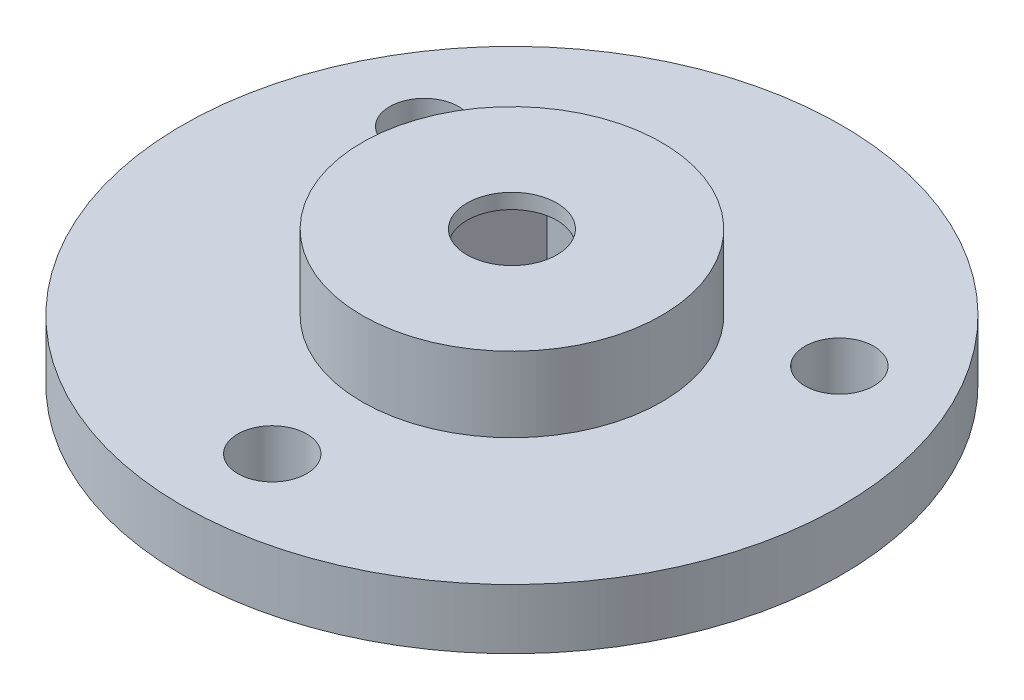
ISO-10303-21;
HEADER;
FILE_DESCRIPTION(('STEP AP214'),'2;1');
FILE_NAME('part.step','',(''),(''),'','','');
FILE_SCHEMA(('AUTOMOTIVE_DESIGN { 1 0 10303 214 1 1 1 1 }'));
ENDSEC;
DATA;
#1=APPLICATION_CONTEXT('core data for automotive mechanical design processes');
#2=APPLICATION_PROTOCOL_DEFINITION('international standard','automotive_design',2000,#1);
#3=PRODUCT_CONTEXT('',#1,'mechanical');
#4=PRODUCT('Part','Part','',(#3));
#5=PRODUCT_RELATED_PRODUCT_CATEGORY('part','',(#4));
#6=PRODUCT_DEFINITION_FORMATION('','',#4);
#7=PRODUCT_DEFINITION_CONTEXT('part definition',#1,'design');
#8=PRODUCT_DEFINITION('design','',#6,#7);
#9=PRODUCT_DEFINITION_SHAPE('','',#8);
#10=(LENGTH_UNIT() NAMED_UNIT(*) SI_UNIT(.MILLI.,.METRE.));
#11=(NAMED_UNIT(*) PLANE_ANGLE_UNIT() SI_UNIT($,.RADIAN.));
#12=(NAMED_UNIT(*) SI_UNIT($,.STERADIAN.) SOLID_ANGLE_UNIT());
#13=UNCERTAINTY_MEASURE_WITH_UNIT(LENGTH_MEASURE(1.E-05),#10,'distance_accuracy_value','');
#14=(GEOMETRIC_REPRESENTATION_CONTEXT(3) GLOBAL_UNCERTAINTY_ASSIGNED_CONTEXT((#13)) GLOBAL_UNIT_ASSIGNED_CONTEXT((#10,
#11,#12)) REPRESENTATION_CONTEXT('',''));
#15=CARTESIAN_POINT('',(0.,0.,0.));
#16=DIRECTION('',(0.,0.,1.));
#17=DIRECTION('',(1.,0.,0.));
#18=AXIS2_PLACEMENT_3D('',#15,#16,#17);
#19=CARTESIAN_POINT('',(0.,2.,0.));
#20=DIRECTION('',(0.,1.,0.));
#21=DIRECTION('',(0.,0.,1.));
#22=AXIS2_PLACEMENT_3D('',#19,#20,#21);
#23=PLANE('',#22);
#24=CARTESIAN_POINT('',(6.92820323027551,2.,-4.));
#25=DIRECTION('',(0.,1.,0.));
#26=DIRECTION('',(0.,0.,1.));
#27=AXIS2_PLACEMENT_3D('',#24,#25,#26);
#28=CIRCLE('',#27,1.15);
#29=CARTESIAN_POINT('',(6.92820323027551,2.,-2.85));
#30=VERTEX_POINT('',#29);
#31=EDGE_CURVE('E137',#30,#30,#28,.T.);
#32=ORIENTED_EDGE('',*,*,#31,.F.);
#33=EDGE_LOOP('',(#32));
#34=FACE_BOUND('',#33,.T.);
#35=CARTESIAN_POINT('',(0.,2.,8.));
#36=DIRECTION('',(0.,1.,0.));
#37=DIRECTION('',(0.,0.,1.));
#38=AXIS2_PLACEMENT_3D('',#35,#36,#37);
#39=CIRCLE('',#38,1.15);
#40=CARTESIAN_POINT('',(0.,2.,9.15));
#41=VERTEX_POINT('',#40);
#42=EDGE_CURVE('E169',#41,#41,#39,.T.);
#43=ORIENTED_EDGE('',*,*,#42,.F.);
#44=EDGE_LOOP('',(#43));
#45=FACE_BOUND('',#44,.T.);
#46=CARTESIAN_POINT('',(0.,2.,0.));
#47=DIRECTION('',(0.,1.,0.));
#48=DIRECTION('',(0.,0.,1.));
#49=AXIS2_PLACEMENT_3D('',#46,#47,#48);
#50=CIRCLE('',#49,11.);
#51=CARTESIAN_POINT('',(0.,2.,11.));
#52=VERTEX_POINT('',#51);
#53=EDGE_CURVE('E11',#52,#52,#50,.T.);
#54=ORIENTED_EDGE('',*,*,#53,.T.);
#55=EDGE_LOOP('',(#54));
#56=FACE_BOUND('',#55,.T.);
#57=CARTESIAN_POINT('',(-6.92820323027551,2.,-4.));
#58=DIRECTION('',(0.,1.,0.));
#59=DIRECTION('',(0.,0.,1.));
#60=AXIS2_PLACEMENT_3D('',#57,#58,#59);
#61=CIRCLE('',#60,1.15);
#62=CARTESIAN_POINT('',(-6.92820323027551,2.,-2.85));
#63=VERTEX_POINT('',#62);
#64=EDGE_CURVE('E143',#63,#63,#61,.T.);
#65=ORIENTED_EDGE('',*,*,#64,.F.);
#66=EDGE_LOOP('',(#65));
#67=FACE_BOUND('',#66,.T.);
#68=CARTESIAN_POINT('',(0.,2.,0.));
#69=DIRECTION('',(0.,1.,0.));
#70=DIRECTION('',(0.,0.,1.));
#71=AXIS2_PLACEMENT_3D('',#68,#69,#70);
#72=CIRCLE('',#71,5.);
#73=CARTESIAN_POINT('',(0.,2.,5.));
#74=VERTEX_POINT('',#73);
#75=EDGE_CURVE('E133',#74,#74,#72,.F.);
#76=ORIENTED_EDGE('',*,*,#75,.T.);
#77=EDGE_LOOP('',(#76));
#78=FACE_BOUND('',#77,.T.);
#79=ADVANCED_FACE('F41',(#34,#45,#56,#67,#78),#23,.T.);
#80=CARTESIAN_POINT('',(0.,0.,0.));
#81=DIRECTION('',(0.,1.,0.));
#82=DIRECTION('',(0.,0.,1.));
#83=AXIS2_PLACEMENT_3D('',#80,#81,#82);
#84=PLANE('',#83);
#85=DIRECTION('',(0.5,0.,-0.866025403784439));
#86=VECTOR('',#85,1.);
#87=CARTESIAN_POINT('',(1.58771324027147,0.,2.75));
#88=LINE('',#87,#86);
#89=CARTESIAN_POINT('',(1.58771324027147,0.,2.75));
#90=VERTEX_POINT('',#89);
#91=CARTESIAN_POINT('',(3.17542648054294,0.,0.));
#92=VERTEX_POINT('',#91);
#93=EDGE_CURVE('E56',#90,#92,#88,.T.);
#94=ORIENTED_EDGE('',*,*,#93,.T.);
#95=DIRECTION('',(-0.5,0.,-0.866025403784438));
#96=VECTOR('',#95,1.);
#97=CARTESIAN_POINT('',(3.17542648054294,0.,0.));
#98=LINE('',#97,#96);
#99=CARTESIAN_POINT('',(1.58771324027147,0.,-2.75));
#100=VERTEX_POINT('',#99);
#101=EDGE_CURVE('E149',#92,#100,#98,.T.);
#102=ORIENTED_EDGE('',*,*,#101,.T.);
#103=DIRECTION('',(-1.,0.,0.));
#104=VECTOR('',#103,1.);
#105=CARTESIAN_POINT('',(1.58771324027147,0.,-2.75));
#106=LINE('',#105,#104);
#107=CARTESIAN_POINT('',(-1.58771324027147,0.,-2.75));
#108=VERTEX_POINT('',#107);
#109=EDGE_CURVE('E113',#100,#108,#106,.T.);
#110=ORIENTED_EDGE('',*,*,#109,.T.);
#111=DIRECTION('',(-0.5,0.,0.866025403784439));
#112=VECTOR('',#111,1.);
#113=CARTESIAN_POINT('',(-1.58771324027147,0.,-2.75));
#114=LINE('',#113,#112);
#115=CARTESIAN_POINT('',(-3.17542648054294,0.,0.));
#116=VERTEX_POINT('',#115);
#117=EDGE_CURVE('E152',#108,#116,#114,.T.);
#118=ORIENTED_EDGE('',*,*,#117,.T.);
#119=DIRECTION('',(0.5,0.,0.866025403784439));
#120=VECTOR('',#119,1.);
#121=CARTESIAN_POINT('',(-3.17542648054294,0.,0.));
#122=LINE('',#121,#120);
#123=CARTESIAN_POINT('',(-1.58771324027147,0.,2.75));
#124=VERTEX_POINT('',#123);
#125=EDGE_CURVE('E155',#116,#124,#122,.T.);
#126=ORIENTED_EDGE('',*,*,#125,.T.);
#127=DIRECTION('',(1.,0.,0.));
#128=VECTOR('',#127,1.);
#129=CARTESIAN_POINT('',(-1.58771324027147,0.,2.75));
#130=LINE('',#129,#128);
#131=EDGE_CURVE('E158',#124,#90,#130,.T.);
#132=ORIENTED_EDGE('',*,*,#131,.T.);
#133=EDGE_LOOP('',(#94,#102,#110,#118,#126,#132));
#134=FACE_BOUND('',#133,.T.);
#135=CARTESIAN_POINT('',(6.92820323027551,0.,-4.));
#136=DIRECTION('',(0.,1.,0.));
#137=DIRECTION('',(0.,0.,1.));
#138=AXIS2_PLACEMENT_3D('',#135,#136,#137);
#139=CIRCLE('',#138,1.15);
#140=CARTESIAN_POINT('',(6.92820323027551,0.,-2.85));
#141=VERTEX_POINT('',#140);
#142=EDGE_CURVE('E136',#141,#141,#139,.T.);
#143=ORIENTED_EDGE('',*,*,#142,.T.);
#144=EDGE_LOOP('',(#143));
#145=FACE_BOUND('',#144,.T.);
#146=CARTESIAN_POINT('',(-6.92820323027551,0.,-4.));
#147=DIRECTION('',(0.,1.,0.));
#148=DIRECTION('',(0.,0.,1.));
#149=AXIS2_PLACEMENT_3D('',#146,#147,#148);
#150=CIRCLE('',#149,1.15);
#151=CARTESIAN_POINT('',(-6.92820323027551,0.,-2.85));
#152=VERTEX_POINT('',#151);
#153=EDGE_CURVE('E140',#152,#152,#150,.T.);
#154=ORIENTED_EDGE('',*,*,#153,.T.);
#155=EDGE_LOOP('',(#154));
#156=FACE_BOUND('',#155,.T.);
#157=CARTESIAN_POINT('',(0.,0.,0.));
#158=DIRECTION('',(0.,1.,0.));
#159=DIRECTION('',(0.,0.,1.));
#160=AXIS2_PLACEMENT_3D('',#157,#158,#159);
#161=CIRCLE('',#160,11.);
#162=CARTESIAN_POINT('',(0.,0.,11.));
#163=VERTEX_POINT('',#162);
#164=EDGE_CURVE('E45',#163,#163,#161,.T.);
#165=ORIENTED_EDGE('',*,*,#164,.F.);
#166=EDGE_LOOP('',(#165));
#167=FACE_BOUND('',#166,.T.);
#168=CARTESIAN_POINT('',(0.,0.,8.));
#169=DIRECTION('',(0.,1.,0.));
#170=DIRECTION('',(0.,0.,1.));
#171=AXIS2_PLACEMENT_3D('',#168,#169,#170);
#172=CIRCLE('',#171,1.15);
#173=CARTESIAN_POINT('',(0.,0.,9.15));
#174=VERTEX_POINT('',#173);
#175=EDGE_CURVE('E168',#174,#174,#172,.T.);
#176=ORIENTED_EDGE('',*,*,#175,.T.);
#177=EDGE_LOOP('',(#176));
#178=FACE_BOUND('',#177,.T.);
#179=ADVANCED_FACE('F175',(#134,#145,#156,#167,#178),#84,.F.);
#180=CARTESIAN_POINT('',(0.,2.,0.));
#181=DIRECTION('',(0.,-1.,0.));
#182=DIRECTION('',(0.,0.,-1.));
#183=AXIS2_PLACEMENT_3D('',#180,#181,#182);
#184=CYLINDRICAL_SURFACE('',#183,11.);
#185=ORIENTED_EDGE('',*,*,#53,.F.);
#186=EDGE_LOOP('',(#185));
#187=FACE_BOUND('',#186,.T.);
#188=ORIENTED_EDGE('',*,*,#164,.T.);
#189=EDGE_LOOP('',(#188));
#190=FACE_BOUND('',#189,.T.);
#191=ADVANCED_FACE('F43',(#187,#190),#184,.T.);
#192=CARTESIAN_POINT('',(0.,2.,8.));
#193=DIRECTION('',(0.,-1.,0.));
#194=DIRECTION('',(0.,0.,-1.));
#195=AXIS2_PLACEMENT_3D('',#192,#193,#194);
#196=CYLINDRICAL_SURFACE('',#195,1.15);
#197=ORIENTED_EDGE('',*,*,#42,.T.);
#198=EDGE_LOOP('',(#197));
#199=FACE_BOUND('',#198,.T.);
#200=ORIENTED_EDGE('',*,*,#175,.F.);
#201=EDGE_LOOP('',(#200));
#202=FACE_BOUND('',#201,.T.);
#203=ADVANCED_FACE('F177',(#199,#202),#196,.F.);
#204=CARTESIAN_POINT('',(1.58771324027147,2.,2.75));
#205=DIRECTION('',(-0.866025403784439,0.,-0.5));
#206=DIRECTION('',(-0.5,0.,0.866025403784439));
#207=AXIS2_PLACEMENT_3D('',#204,#205,#206);
#208=PLANE('',#207);
#209=ORIENTED_EDGE('',*,*,#93,.F.);
#210=DIRECTION('',(0.,-1.,0.));
#211=VECTOR('',#210,1.);
#212=CARTESIAN_POINT('',(1.58771324027147,2.,2.75));
#213=LINE('',#212,#211);
#214=CARTESIAN_POINT('',(1.58771324027147,4.,2.75));
#215=VERTEX_POINT('',#214);
#216=EDGE_CURVE('E161',#215,#90,#213,.T.);
#217=ORIENTED_EDGE('',*,*,#216,.F.);
#218=DIRECTION('',(0.5,0.,-0.866025403784439));
#219=VECTOR('',#218,1.);
#220=CARTESIAN_POINT('',(1.58771324027147,4.,2.75));
#221=LINE('',#220,#219);
#222=CARTESIAN_POINT('',(3.17542648054294,4.,0.));
#223=VERTEX_POINT('',#222);
#224=EDGE_CURVE('E121',#215,#223,#221,.T.);
#225=ORIENTED_EDGE('',*,*,#224,.T.);
#226=DIRECTION('',(0.,-1.,0.));
#227=VECTOR('',#226,1.);
#228=CARTESIAN_POINT('',(3.17542648054294,2.,0.));
#229=LINE('',#228,#227);
#230=EDGE_CURVE('E116',#223,#92,#229,.T.);
#231=ORIENTED_EDGE('',*,*,#230,.T.);
#232=EDGE_LOOP('',(#209,#217,#225,#231));
#233=FACE_BOUND('',#232,.T.);
#234=ADVANCED_FACE('F179',(#233),#208,.T.);
#235=CARTESIAN_POINT('',(3.17542648054294,2.,0.));
#236=DIRECTION('',(-0.866025403784439,0.,0.5));
#237=DIRECTION('',(0.5,0.,0.866025403784438));
#238=AXIS2_PLACEMENT_3D('',#235,#236,#237);
#239=PLANE('',#238);
#240=ORIENTED_EDGE('',*,*,#101,.F.);
#241=ORIENTED_EDGE('',*,*,#230,.F.);
#242=DIRECTION('',(-0.5,0.,-0.866025403784438));
#243=VECTOR('',#242,1.);
#244=CARTESIAN_POINT('',(3.17542648054294,4.,0.));
#245=LINE('',#244,#243);
#246=CARTESIAN_POINT('',(1.58771324027147,4.,-2.75));
#247=VERTEX_POINT('',#246);
#248=EDGE_CURVE('E102',#223,#247,#245,.T.);
#249=ORIENTED_EDGE('',*,*,#248,.T.);
#250=DIRECTION('',(0.,-1.,0.));
#251=VECTOR('',#250,1.);
#252=CARTESIAN_POINT('',(1.58771324027147,2.,-2.75));
#253=LINE('',#252,#251);
#254=EDGE_CURVE('E110',#247,#100,#253,.T.);
#255=ORIENTED_EDGE('',*,*,#254,.T.);
#256=EDGE_LOOP('',(#240,#241,#249,#255));
#257=FACE_BOUND('',#256,.T.);
#258=ADVANCED_FACE('F119',(#257),#239,.T.);
#259=CARTESIAN_POINT('',(1.58771324027147,2.,-2.75));
#260=DIRECTION('',(0.,0.,1.));
#261=DIRECTION('',(1.,0.,0.));
#262=AXIS2_PLACEMENT_3D('',#259,#260,#261);
#263=PLANE('',#262);
#264=ORIENTED_EDGE('',*,*,#109,.F.);
#265=ORIENTED_EDGE('',*,*,#254,.F.);
#266=DIRECTION('',(-1.,0.,0.));
#267=VECTOR('',#266,1.);
#268=CARTESIAN_POINT('',(1.58771324027147,4.,-2.75));
#269=LINE('',#268,#267);
#270=CARTESIAN_POINT('',(-1.58771324027147,4.,-2.75));
#271=VERTEX_POINT('',#270);
#272=EDGE_CURVE('E97',#247,#271,#269,.T.);
#273=ORIENTED_EDGE('',*,*,#272,.T.);
#274=DIRECTION('',(0.,-1.,0.));
#275=VECTOR('',#274,1.);
#276=CARTESIAN_POINT('',(-1.58771324027147,2.,-2.75));
#277=LINE('',#276,#275);
#278=EDGE_CURVE('E117',#271,#108,#277,.T.);
#279=ORIENTED_EDGE('',*,*,#278,.T.);
#280=EDGE_LOOP('',(#264,#265,#273,#279));
#281=FACE_BOUND('',#280,.T.);
#282=ADVANCED_FACE('F111',(#281),#263,.T.);
#283=CARTESIAN_POINT('',(-1.58771324027147,2.,-2.75));
#284=DIRECTION('',(0.866025403784439,0.,0.5));
#285=DIRECTION('',(0.5,0.,-0.866025403784439));
#286=AXIS2_PLACEMENT_3D('',#283,#284,#285);
#287=PLANE('',#286);
#288=ORIENTED_EDGE('',*,*,#117,.F.);
#289=ORIENTED_EDGE('',*,*,#278,.F.);
#290=DIRECTION('',(-0.5,0.,0.866025403784439));
#291=VECTOR('',#290,1.);
#292=CARTESIAN_POINT('',(-1.58771324027147,4.,-2.75));
#293=LINE('',#292,#291);
#294=CARTESIAN_POINT('',(-3.17542648054294,4.,0.));
#295=VERTEX_POINT('',#294);
#296=EDGE_CURVE('E105',#271,#295,#293,.T.);
#297=ORIENTED_EDGE('',*,*,#296,.T.);
#298=DIRECTION('',(0.,-1.,0.));
#299=VECTOR('',#298,1.);
#300=CARTESIAN_POINT('',(-3.17542648054294,2.,0.));
#301=LINE('',#300,#299);
#302=EDGE_CURVE('E164',#295,#116,#301,.T.);
#303=ORIENTED_EDGE('',*,*,#302,.T.);
#304=EDGE_LOOP('',(#288,#289,#297,#303));
#305=FACE_BOUND('',#304,.T.);
#306=ADVANCED_FACE('F247',(#305),#287,.T.);
#307=CARTESIAN_POINT('',(-3.17542648054294,2.,0.));
#308=DIRECTION('',(0.866025403784439,0.,-0.5));
#309=DIRECTION('',(-0.5,0.,-0.866025403784439));
#310=AXIS2_PLACEMENT_3D('',#307,#308,#309);
#311=PLANE('',#310);
#312=ORIENTED_EDGE('',*,*,#125,.F.);
#313=ORIENTED_EDGE('',*,*,#302,.F.);
#314=DIRECTION('',(0.5,0.,0.866025403784439));
#315=VECTOR('',#314,1.);
#316=CARTESIAN_POINT('',(-3.17542648054294,4.,0.));
#317=LINE('',#316,#315);
#318=CARTESIAN_POINT('',(-1.58771324027147,4.,2.75));
#319=VERTEX_POINT('',#318);
#320=EDGE_CURVE('E128',#295,#319,#317,.T.);
#321=ORIENTED_EDGE('',*,*,#320,.T.);
#322=DIRECTION('',(0.,-1.,0.));
#323=VECTOR('',#322,1.);
#324=CARTESIAN_POINT('',(-1.58771324027147,2.,2.75));
#325=LINE('',#324,#323);
#326=EDGE_CURVE('E64',#319,#124,#325,.T.);
#327=ORIENTED_EDGE('',*,*,#326,.T.);
#328=EDGE_LOOP('',(#312,#313,#321,#327));
#329=FACE_BOUND('',#328,.T.);
#330=ADVANCED_FACE('F243',(#329),#311,.T.);
#331=CARTESIAN_POINT('',(-1.58771324027147,2.,2.75));
#332=DIRECTION('',(0.,0.,-1.));
#333=DIRECTION('',(-1.,0.,0.));
#334=AXIS2_PLACEMENT_3D('',#331,#332,#333);
#335=PLANE('',#334);
#336=ORIENTED_EDGE('',*,*,#131,.F.);
#337=ORIENTED_EDGE('',*,*,#326,.F.);
#338=DIRECTION('',(1.,0.,0.));
#339=VECTOR('',#338,1.);
#340=CARTESIAN_POINT('',(-1.58771324027147,4.,2.75));
#341=LINE('',#340,#339);
#342=EDGE_CURVE('E130',#319,#215,#341,.T.);
#343=ORIENTED_EDGE('',*,*,#342,.T.);
#344=ORIENTED_EDGE('',*,*,#216,.T.);
#345=EDGE_LOOP('',(#336,#337,#343,#344));
#346=FACE_BOUND('',#345,.T.);
#347=ADVANCED_FACE('F239',(#346),#335,.T.);
#348=CARTESIAN_POINT('',(-6.92820323027551,2.,-4.));
#349=DIRECTION('',(0.,-1.,0.));
#350=DIRECTION('',(0.,0.,-1.));
#351=AXIS2_PLACEMENT_3D('',#348,#349,#350);
#352=CYLINDRICAL_SURFACE('',#351,1.15);
#353=ORIENTED_EDGE('',*,*,#64,.T.);
#354=EDGE_LOOP('',(#353));
#355=FACE_BOUND('',#354,.T.);
#356=ORIENTED_EDGE('',*,*,#153,.F.);
#357=EDGE_LOOP('',(#356));
#358=FACE_BOUND('',#357,.T.);
#359=ADVANCED_FACE('F236',(#355,#358),#352,.F.);
#360=CARTESIAN_POINT('',(6.92820323027551,2.,-4.));
#361=DIRECTION('',(0.,-1.,0.));
#362=DIRECTION('',(0.,0.,-1.));
#363=AXIS2_PLACEMENT_3D('',#360,#361,#362);
#364=CYLINDRICAL_SURFACE('',#363,1.15);
#365=ORIENTED_EDGE('',*,*,#31,.T.);
#366=EDGE_LOOP('',(#365));
#367=FACE_BOUND('',#366,.T.);
#368=ORIENTED_EDGE('',*,*,#142,.F.);
#369=EDGE_LOOP('',(#368));
#370=FACE_BOUND('',#369,.T.);
#371=ADVANCED_FACE('F211',(#367,#370),#364,.F.);
#372=CARTESIAN_POINT('',(0.,4.,0.));
#373=DIRECTION('',(0.,-1.,0.));
#374=DIRECTION('',(0.,0.,-1.));
#375=AXIS2_PLACEMENT_3D('',#372,#373,#374);
#376=CYLINDRICAL_SURFACE('',#375,5.);
#377=ORIENTED_EDGE('',*,*,#75,.F.);
#378=EDGE_LOOP('',(#377));
#379=FACE_BOUND('',#378,.T.);
#380=CARTESIAN_POINT('',(0.,4.5,0.));
#381=DIRECTION('',(0.,1.,0.));
#382=DIRECTION('',(0.,0.,1.));
#383=AXIS2_PLACEMENT_3D('',#380,#381,#382);
#384=CIRCLE('',#383,5.);
#385=CARTESIAN_POINT('',(0.,4.5,5.));
#386=VERTEX_POINT('',#385);
#387=EDGE_CURVE('E123',#386,#386,#384,.T.);
#388=ORIENTED_EDGE('',*,*,#387,.F.);
#389=EDGE_LOOP('',(#388));
#390=FACE_BOUND('',#389,.T.);
#391=ADVANCED_FACE('F207',(#379,#390),#376,.T.);
#392=CARTESIAN_POINT('',(0.,4.5,0.));
#393=DIRECTION('',(0.,1.,0.));
#394=DIRECTION('',(0.,0.,1.));
#395=AXIS2_PLACEMENT_3D('',#392,#393,#394);
#396=PLANE('',#395);
#397=ORIENTED_EDGE('',*,*,#387,.T.);
#398=EDGE_LOOP('',(#397));
#399=FACE_BOUND('',#398,.T.);
#400=CARTESIAN_POINT('',(0.,4.5,0.));
#401=DIRECTION('',(0.,1.,0.));
#402=DIRECTION('',(0.,0.,1.));
#403=AXIS2_PLACEMENT_3D('',#400,#401,#402);
#404=CIRCLE('',#403,1.5);
#405=CARTESIAN_POINT('',(0.,4.5,1.5));
#406=VERTEX_POINT('',#405);
#407=EDGE_CURVE('E216',#406,#406,#404,.T.);
#408=ORIENTED_EDGE('',*,*,#407,.F.);
#409=EDGE_LOOP('',(#408));
#410=FACE_BOUND('',#409,.T.);
#411=ADVANCED_FACE('F210',(#399,#410),#396,.T.);
#412=CARTESIAN_POINT('',(0.,4.,0.));
#413=DIRECTION('',(0.,1.,0.));
#414=DIRECTION('',(0.,0.,1.));
#415=AXIS2_PLACEMENT_3D('',#412,#413,#414);
#416=PLANE('',#415);
#417=ORIENTED_EDGE('',*,*,#248,.F.);
#418=ORIENTED_EDGE('',*,*,#224,.F.);
#419=ORIENTED_EDGE('',*,*,#342,.F.);
#420=ORIENTED_EDGE('',*,*,#320,.F.);
#421=ORIENTED_EDGE('',*,*,#296,.F.);
#422=ORIENTED_EDGE('',*,*,#272,.F.);
#423=EDGE_LOOP('',(#417,#418,#419,#420,#421,#422));
#424=FACE_BOUND('',#423,.T.);
#425=CARTESIAN_POINT('',(0.,4.,0.));
#426=DIRECTION('',(0.,1.,0.));
#427=DIRECTION('',(0.,0.,1.));
#428=AXIS2_PLACEMENT_3D('',#425,#426,#427);
#429=CIRCLE('',#428,1.5);
#430=CARTESIAN_POINT('',(0.,4.,1.5));
#431=VERTEX_POINT('',#430);
#432=EDGE_CURVE('E218',#431,#431,#429,.T.);
#433=ORIENTED_EDGE('',*,*,#432,.T.);
#434=EDGE_LOOP('',(#433));
#435=FACE_BOUND('',#434,.T.);
#436=ADVANCED_FACE('F99',(#424,#435),#416,.F.);
#437=CARTESIAN_POINT('',(0.,4.5,0.));
#438=DIRECTION('',(0.,-1.,0.));
#439=DIRECTION('',(0.,0.,-1.));
#440=AXIS2_PLACEMENT_3D('',#437,#438,#439);
#441=CYLINDRICAL_SURFACE('',#440,1.5);
#442=ORIENTED_EDGE('',*,*,#407,.T.);
#443=EDGE_LOOP('',(#442));
#444=FACE_BOUND('',#443,.T.);
#445=ORIENTED_EDGE('',*,*,#432,.F.);
#446=EDGE_LOOP('',(#445));
#447=FACE_BOUND('',#446,.T.);
#448=ADVANCED_FACE('F224',(#444,#447),#441,.F.);
#449=CLOSED_SHELL('',(#79,#179,#191,#203,#234,#258,#282,#306,#330,#347,#359,#371,#391,#411,#436,#448));
#450=MANIFOLD_SOLID_BREP('B2',#449);
#451=ADVANCED_BREP_SHAPE_REPRESENTATION('',(#18,#450),#14);
#452=SHAPE_DEFINITION_REPRESENTATION(#9,#451);
ENDSEC;
END-ISO-10303-21;
